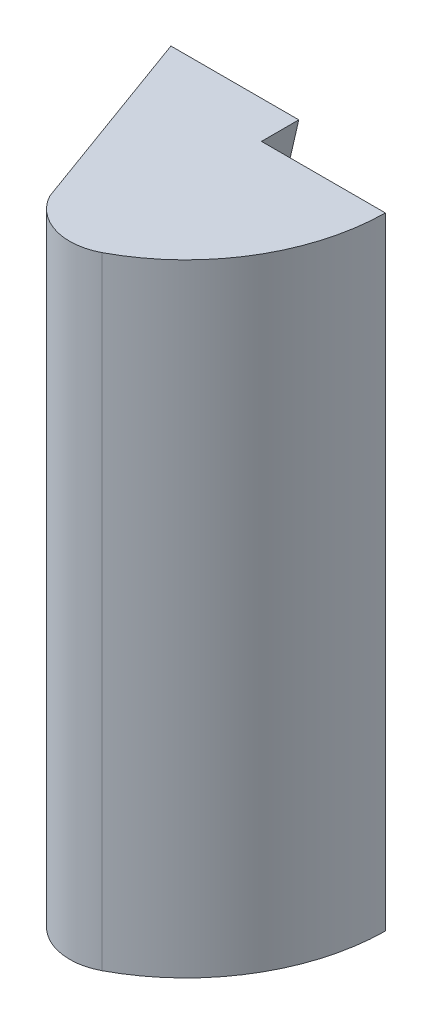
ISO-10303-21;
HEADER;
FILE_DESCRIPTION(('STEP AP214'),'2;1');
FILE_NAME('part.step','',(''),(''),'','','');
FILE_SCHEMA(('AUTOMOTIVE_DESIGN { 1 0 10303 214 1 1 1 1 }'));
ENDSEC;
DATA;
#1=APPLICATION_CONTEXT('core data for automotive mechanical design processes');
#2=APPLICATION_PROTOCOL_DEFINITION('international standard','automotive_design',2000,#1);
#3=PRODUCT_CONTEXT('',#1,'mechanical');
#4=PRODUCT('Part','Part','',(#3));
#5=PRODUCT_RELATED_PRODUCT_CATEGORY('part','',(#4));
#6=PRODUCT_DEFINITION_FORMATION('','',#4);
#7=PRODUCT_DEFINITION_CONTEXT('part definition',#1,'design');
#8=PRODUCT_DEFINITION('design','',#6,#7);
#9=PRODUCT_DEFINITION_SHAPE('','',#8);
#10=(LENGTH_UNIT() NAMED_UNIT(*) SI_UNIT(.MILLI.,.METRE.));
#11=(NAMED_UNIT(*) PLANE_ANGLE_UNIT() SI_UNIT($,.RADIAN.));
#12=(NAMED_UNIT(*) SI_UNIT($,.STERADIAN.) SOLID_ANGLE_UNIT());
#13=UNCERTAINTY_MEASURE_WITH_UNIT(LENGTH_MEASURE(1.E-05),#10,'distance_accuracy_value','');
#14=(GEOMETRIC_REPRESENTATION_CONTEXT(3) GLOBAL_UNCERTAINTY_ASSIGNED_CONTEXT((#13)) GLOBAL_UNIT_ASSIGNED_CONTEXT((#10,
#11,#12)) REPRESENTATION_CONTEXT('',''));
#15=CARTESIAN_POINT('',(0.,0.,0.));
#16=DIRECTION('',(0.,0.,1.));
#17=DIRECTION('',(1.,0.,0.));
#18=AXIS2_PLACEMENT_3D('',#15,#16,#17);
#19=CARTESIAN_POINT('',(-2.81712764111581,0.,-15.9767247746024));
#20=DIRECTION('',(0.,1.,0.));
#21=DIRECTION('',(0.,0.,1.));
#22=AXIS2_PLACEMENT_3D('',#19,#20,#21);
#23=PLANE('',#22);
#24=DIRECTION('',(-1.,0.,0.));
#25=VECTOR('',#24,1.);
#26=CARTESIAN_POINT('',(0.,0.,-15.7938524157181));
#27=LINE('',#26,#25);
#28=CARTESIAN_POINT('',(13.40503313882,0.,-15.7938524157181));
#29=VERTEX_POINT('',#28);
#30=CARTESIAN_POINT('',(3.44087633369856,0.,-15.7938524157181));
#31=VERTEX_POINT('',#30);
#32=EDGE_CURVE('E155',#29,#31,#27,.T.);
#33=ORIENTED_EDGE('',*,*,#32,.F.);
#34=CARTESIAN_POINT('',(-2.81712764111581,0.,-15.9767247746024));
#35=DIRECTION('',(0.,1.,0.));
#36=DIRECTION('',(0.,0.,1.));
#37=AXIS2_PLACEMENT_3D('',#34,#35,#36);
#38=CIRCLE('',#37,16.2231915069055);
#39=CARTESIAN_POINT('',(4.76548522397194,0.,-1.63462155338905));
#40=VERTEX_POINT('',#39);
#41=EDGE_CURVE('E193',#40,#29,#38,.T.);
#42=ORIENTED_EDGE('',*,*,#41,.F.);
#43=CARTESIAN_POINT('',(2.68780975575991,0.,-5.62536315985617));
#44=DIRECTION('',(0.,1.,0.));
#45=DIRECTION('',(0.,0.,1.));
#46=AXIS2_PLACEMENT_3D('',#43,#44,#45);
#47=CIRCLE('',#46,4.49919480805154);
#48=CARTESIAN_POINT('',(-1.26592555584578,0.,-3.47810187939677));
#49=VERTEX_POINT('',#48);
#50=EDGE_CURVE('E187',#49,#40,#47,.T.);
#51=ORIENTED_EDGE('',*,*,#50,.F.);
#52=DIRECTION('',(0.342020143325673,0.,0.939692620785907));
#53=VECTOR('',#52,1.);
#54=CARTESIAN_POINT('',(-6.84040286651345,0.,-18.7938524157181));
#55=LINE('',#54,#53);
#56=CARTESIAN_POINT('',(-6.84040286651345,0.,-18.7938524157181));
#57=VERTEX_POINT('',#56);
#58=EDGE_CURVE('E199',#57,#49,#55,.T.);
#59=ORIENTED_EDGE('',*,*,#58,.F.);
#60=DIRECTION('',(-1.,0.,0.));
#61=VECTOR('',#60,1.);
#62=CARTESIAN_POINT('',(13.1595971334865,0.,-18.7938524157181));
#63=LINE('',#62,#61);
#64=CARTESIAN_POINT('',(3.44087633369856,0.,-18.7938524157181));
#65=VERTEX_POINT('',#64);
#66=EDGE_CURVE('E205',#65,#57,#63,.T.);
#67=ORIENTED_EDGE('',*,*,#66,.F.);
#68=DIRECTION('',(0.,0.,-1.));
#69=VECTOR('',#68,1.);
#70=CARTESIAN_POINT('',(3.44087633369856,0.,-15.7938524157181));
#71=LINE('',#70,#69);
#72=EDGE_CURVE('E173',#31,#65,#71,.T.);
#73=ORIENTED_EDGE('',*,*,#72,.F.);
#74=EDGE_LOOP('',(#33,#42,#51,#59,#67,#73));
#75=FACE_BOUND('',#74,.T.);
#76=ADVANCED_FACE('F36',(#75),#23,.F.);
#77=CARTESIAN_POINT('',(-2.81712764111581,50.,-15.9767247746024));
#78=DIRECTION('',(0.,-1.,0.));
#79=DIRECTION('',(0.,0.,-1.));
#80=AXIS2_PLACEMENT_3D('',#77,#78,#79);
#81=CYLINDRICAL_SURFACE('',#80,16.2231915069055);
#82=DIRECTION('',(0.,-1.,0.));
#83=VECTOR('',#82,1.);
#84=CARTESIAN_POINT('',(13.40503313882,50.,-15.7938524157181));
#85=LINE('',#84,#83);
#86=CARTESIAN_POINT('',(13.40503313882,50.,-15.7938524157181));
#87=VERTEX_POINT('',#86);
#88=EDGE_CURVE('E144',#87,#29,#85,.T.);
#89=ORIENTED_EDGE('',*,*,#88,.F.);
#90=CARTESIAN_POINT('',(-2.81712764111581,50.,-15.9767247746024));
#91=DIRECTION('',(0.,1.,0.));
#92=DIRECTION('',(0.,0.,1.));
#93=AXIS2_PLACEMENT_3D('',#90,#91,#92);
#94=CIRCLE('',#93,16.2231915069055);
#95=CARTESIAN_POINT('',(4.76548522397194,50.,-1.63462155338905));
#96=VERTEX_POINT('',#95);
#97=EDGE_CURVE('E195',#96,#87,#94,.T.);
#98=ORIENTED_EDGE('',*,*,#97,.F.);
#99=DIRECTION('',(0.,1.,0.));
#100=VECTOR('',#99,1.);
#101=CARTESIAN_POINT('',(4.76548522397194,0.,-1.63462155338905));
#102=LINE('',#101,#100);
#103=EDGE_CURVE('E191',#40,#96,#102,.T.);
#104=ORIENTED_EDGE('',*,*,#103,.F.);
#105=ORIENTED_EDGE('',*,*,#41,.T.);
#106=EDGE_LOOP('',(#89,#98,#104,#105));
#107=FACE_BOUND('',#106,.T.);
#108=ADVANCED_FACE('F38',(#107),#81,.T.);
#109=CARTESIAN_POINT('',(-2.81712764111581,50.,-15.9767247746024));
#110=DIRECTION('',(0.,1.,0.));
#111=DIRECTION('',(0.,0.,1.));
#112=AXIS2_PLACEMENT_3D('',#109,#110,#111);
#113=PLANE('',#112);
#114=ORIENTED_EDGE('',*,*,#97,.T.);
#115=DIRECTION('',(1.,0.,0.));
#116=VECTOR('',#115,1.);
#117=CARTESIAN_POINT('',(0.,50.,-15.7938524157181));
#118=LINE('',#117,#116);
#119=CARTESIAN_POINT('',(3.44087633369857,50.,-15.7938524157181));
#120=VERTEX_POINT('',#119);
#121=EDGE_CURVE('E153',#120,#87,#118,.T.);
#122=ORIENTED_EDGE('',*,*,#121,.F.);
#123=DIRECTION('',(0.,0.,-1.));
#124=VECTOR('',#123,1.);
#125=CARTESIAN_POINT('',(3.44087633369857,50.,-15.7938524157181));
#126=LINE('',#125,#124);
#127=CARTESIAN_POINT('',(3.44087633369857,50.,-18.7938524157181));
#128=VERTEX_POINT('',#127);
#129=EDGE_CURVE('E176',#120,#128,#126,.T.);
#130=ORIENTED_EDGE('',*,*,#129,.T.);
#131=DIRECTION('',(-1.,0.,0.));
#132=VECTOR('',#131,1.);
#133=CARTESIAN_POINT('',(13.1595971334865,50.,-18.7938524157181));
#134=LINE('',#133,#132);
#135=CARTESIAN_POINT('',(-6.84040286651345,50.,-18.7938524157181));
#136=VERTEX_POINT('',#135);
#137=EDGE_CURVE('E198',#128,#136,#134,.T.);
#138=ORIENTED_EDGE('',*,*,#137,.T.);
#139=DIRECTION('',(0.342020143325673,0.,0.939692620785907));
#140=VECTOR('',#139,1.);
#141=CARTESIAN_POINT('',(-6.84040286651345,50.,-18.7938524157181));
#142=LINE('',#141,#140);
#143=CARTESIAN_POINT('',(-1.26592555584578,50.,-3.47810187939677));
#144=VERTEX_POINT('',#143);
#145=EDGE_CURVE('E44',#136,#144,#142,.T.);
#146=ORIENTED_EDGE('',*,*,#145,.T.);
#147=CARTESIAN_POINT('',(2.68780975575991,50.,-5.62536315985617));
#148=DIRECTION('',(0.,1.,0.));
#149=DIRECTION('',(0.,0.,1.));
#150=AXIS2_PLACEMENT_3D('',#147,#148,#149);
#151=CIRCLE('',#150,4.49919480805154);
#152=EDGE_CURVE('E184',#144,#96,#151,.T.);
#153=ORIENTED_EDGE('',*,*,#152,.T.);
#154=EDGE_LOOP('',(#114,#122,#130,#138,#146,#153));
#155=FACE_BOUND('',#154,.T.);
#156=ADVANCED_FACE('F223',(#155),#113,.T.);
#157=CARTESIAN_POINT('',(13.1595971334865,50.,-18.7938524157181));
#158=DIRECTION('',(0.,0.,1.));
#159=DIRECTION('',(1.,0.,0.));
#160=AXIS2_PLACEMENT_3D('',#157,#158,#159);
#161=PLANE('',#160);
#162=DIRECTION('',(0.,-1.,0.));
#163=VECTOR('',#162,1.);
#164=CARTESIAN_POINT('',(-1.94561929768702,0.,-18.7938524157181));
#165=LINE('',#164,#163);
#166=CARTESIAN_POINT('',(-1.94561929768702,36.,-18.7938524157181));
#167=VERTEX_POINT('',#166);
#168=CARTESIAN_POINT('',(-1.94561929768702,14.,-18.7938524157181));
#169=VERTEX_POINT('',#168);
#170=EDGE_CURVE('E135',#167,#169,#165,.T.);
#171=ORIENTED_EDGE('',*,*,#170,.T.);
#172=DIRECTION('',(1.,0.,0.));
#173=VECTOR('',#172,1.);
#174=CARTESIAN_POINT('',(0.,14.,-18.7938524157181));
#175=LINE('',#174,#173);
#176=CARTESIAN_POINT('',(0.208721657940766,14.,-18.7938524157181));
#177=VERTEX_POINT('',#176);
#178=EDGE_CURVE('E166',#169,#177,#175,.T.);
#179=ORIENTED_EDGE('',*,*,#178,.T.);
#180=DIRECTION('',(0.224951054343859,-0.974370064785237,0.));
#181=VECTOR('',#180,1.);
#182=CARTESIAN_POINT('',(3.26675774823927,0.754190452181398,-18.7938524157181));
#183=LINE('',#182,#181);
#184=EDGE_CURVE('E51',#177,#65,#183,.T.);
#185=ORIENTED_EDGE('',*,*,#184,.T.);
#186=ORIENTED_EDGE('',*,*,#66,.T.);
#187=DIRECTION('',(0.,-1.,0.));
#188=VECTOR('',#187,1.);
#189=CARTESIAN_POINT('',(-6.84040286651345,50.,-18.7938524157181));
#190=LINE('',#189,#188);
#191=EDGE_CURVE('E12',#136,#57,#190,.T.);
#192=ORIENTED_EDGE('',*,*,#191,.F.);
#193=ORIENTED_EDGE('',*,*,#137,.F.);
#194=DIRECTION('',(-0.224951054343863,-0.974370064785236,0.));
#195=VECTOR('',#194,1.);
#196=CARTESIAN_POINT('',(-7.69252092148749,1.77595839033934,-18.7938524157181));
#197=LINE('',#196,#195);
#198=CARTESIAN_POINT('',(0.208721657940777,36.,-18.7938524157181));
#199=VERTEX_POINT('',#198);
#200=EDGE_CURVE('E150',#128,#199,#197,.T.);
#201=ORIENTED_EDGE('',*,*,#200,.T.);
#202=DIRECTION('',(1.,0.,0.));
#203=VECTOR('',#202,1.);
#204=CARTESIAN_POINT('',(0.,36.,-18.7938524157181));
#205=LINE('',#204,#203);
#206=EDGE_CURVE('E169',#167,#199,#205,.T.);
#207=ORIENTED_EDGE('',*,*,#206,.F.);
#208=EDGE_LOOP('',(#171,#179,#185,#186,#192,#193,#201,#207));
#209=FACE_BOUND('',#208,.T.);
#210=ADVANCED_FACE('F226',(#209),#161,.F.);
#211=CARTESIAN_POINT('',(-6.84040286651345,50.,-18.7938524157181));
#212=DIRECTION('',(0.939692620785907,0.,-0.342020143325673));
#213=DIRECTION('',(-0.342020143325673,0.,-0.939692620785907));
#214=AXIS2_PLACEMENT_3D('',#211,#212,#213);
#215=PLANE('',#214);
#216=DIRECTION('',(0.,1.,0.));
#217=VECTOR('',#216,1.);
#218=CARTESIAN_POINT('',(-1.26592555584578,0.,-3.47810187939677));
#219=LINE('',#218,#217);
#220=EDGE_CURVE('E59',#49,#144,#219,.T.);
#221=ORIENTED_EDGE('',*,*,#220,.T.);
#222=ORIENTED_EDGE('',*,*,#145,.F.);
#223=ORIENTED_EDGE('',*,*,#191,.T.);
#224=ORIENTED_EDGE('',*,*,#58,.T.);
#225=EDGE_LOOP('',(#221,#222,#223,#224));
#226=FACE_BOUND('',#225,.T.);
#227=ADVANCED_FACE('F209',(#226),#215,.F.);
#228=CARTESIAN_POINT('',(2.68780975575991,0.,-5.62536315985617));
#229=DIRECTION('',(0.,1.,0.));
#230=DIRECTION('',(0.,0.,1.));
#231=AXIS2_PLACEMENT_3D('',#228,#229,#230);
#232=CYLINDRICAL_SURFACE('',#231,4.49919480805154);
#233=ORIENTED_EDGE('',*,*,#152,.F.);
#234=ORIENTED_EDGE('',*,*,#220,.F.);
#235=ORIENTED_EDGE('',*,*,#50,.T.);
#236=ORIENTED_EDGE('',*,*,#103,.T.);
#237=EDGE_LOOP('',(#233,#234,#235,#236));
#238=FACE_BOUND('',#237,.T.);
#239=ADVANCED_FACE('F217',(#238),#232,.T.);
#240=CARTESIAN_POINT('',(3.26675774823927,0.754190452181398,-15.7938524157181));
#241=DIRECTION('',(0.974370064785236,0.224951054343859,0.));
#242=DIRECTION('',(-0.224951054343859,0.974370064785237,0.));
#243=AXIS2_PLACEMENT_3D('',#240,#241,#242);
#244=PLANE('',#243);
#245=ORIENTED_EDGE('',*,*,#184,.F.);
#246=DIRECTION('',(0.,0.,-1.));
#247=VECTOR('',#246,1.);
#248=CARTESIAN_POINT('',(0.208721657940766,14.,-15.7938524157181));
#249=LINE('',#248,#247);
#250=CARTESIAN_POINT('',(0.208721657940766,14.,-15.7938524157181));
#251=VERTEX_POINT('',#250);
#252=EDGE_CURVE('E164',#251,#177,#249,.T.);
#253=ORIENTED_EDGE('',*,*,#252,.F.);
#254=DIRECTION('',(0.224951054343859,-0.974370064785237,0.));
#255=VECTOR('',#254,1.);
#256=CARTESIAN_POINT('',(3.26675774823927,0.754190452181398,-15.7938524157181));
#257=LINE('',#256,#255);
#258=EDGE_CURVE('E148',#251,#31,#257,.T.);
#259=ORIENTED_EDGE('',*,*,#258,.T.);
#260=ORIENTED_EDGE('',*,*,#72,.T.);
#261=EDGE_LOOP('',(#245,#253,#259,#260));
#262=FACE_BOUND('',#261,.T.);
#263=ADVANCED_FACE('F229',(#262),#244,.T.);
#264=CARTESIAN_POINT('',(-7.69252092148749,1.77595839033934,-15.7938524157181));
#265=DIRECTION('',(0.974370064785236,-0.224951054343863,0.));
#266=DIRECTION('',(0.224951054343863,0.974370064785236,0.));
#267=AXIS2_PLACEMENT_3D('',#264,#265,#266);
#268=PLANE('',#267);
#269=ORIENTED_EDGE('',*,*,#200,.F.);
#270=ORIENTED_EDGE('',*,*,#129,.F.);
#271=DIRECTION('',(-0.224951054343863,-0.974370064785236,0.));
#272=VECTOR('',#271,1.);
#273=CARTESIAN_POINT('',(-7.69252092148749,1.77595839033934,-15.7938524157181));
#274=LINE('',#273,#272);
#275=CARTESIAN_POINT('',(0.208721657940778,36.,-15.7938524157181));
#276=VERTEX_POINT('',#275);
#277=EDGE_CURVE('E125',#120,#276,#274,.T.);
#278=ORIENTED_EDGE('',*,*,#277,.T.);
#279=DIRECTION('',(0.,0.,-1.));
#280=VECTOR('',#279,1.);
#281=CARTESIAN_POINT('',(0.208721657940778,36.,-15.7938524157181));
#282=LINE('',#281,#280);
#283=EDGE_CURVE('E121',#276,#199,#282,.T.);
#284=ORIENTED_EDGE('',*,*,#283,.T.);
#285=EDGE_LOOP('',(#269,#270,#278,#284));
#286=FACE_BOUND('',#285,.T.);
#287=ADVANCED_FACE('F231',(#286),#268,.T.);
#288=CARTESIAN_POINT('',(0.,36.,-15.7938524157181));
#289=DIRECTION('',(0.,1.,0.));
#290=DIRECTION('',(0.,0.,1.));
#291=AXIS2_PLACEMENT_3D('',#288,#289,#290);
#292=PLANE('',#291);
#293=ORIENTED_EDGE('',*,*,#206,.T.);
#294=ORIENTED_EDGE('',*,*,#283,.F.);
#295=DIRECTION('',(1.,0.,0.));
#296=VECTOR('',#295,1.);
#297=CARTESIAN_POINT('',(0.,36.,-15.7938524157181));
#298=LINE('',#297,#296);
#299=CARTESIAN_POINT('',(-1.94561929768702,36.,-15.7938524157181));
#300=VERTEX_POINT('',#299);
#301=EDGE_CURVE('E115',#300,#276,#298,.T.);
#302=ORIENTED_EDGE('',*,*,#301,.F.);
#303=DIRECTION('',(0.,0.,-1.));
#304=VECTOR('',#303,1.);
#305=CARTESIAN_POINT('',(-1.94561929768702,36.,-15.7938524157181));
#306=LINE('',#305,#304);
#307=EDGE_CURVE('E119',#300,#167,#306,.T.);
#308=ORIENTED_EDGE('',*,*,#307,.T.);
#309=EDGE_LOOP('',(#293,#294,#302,#308));
#310=FACE_BOUND('',#309,.T.);
#311=ADVANCED_FACE('F118',(#310),#292,.F.);
#312=CARTESIAN_POINT('',(0.,14.,-15.7938524157181));
#313=DIRECTION('',(0.,1.,0.));
#314=DIRECTION('',(0.,0.,1.));
#315=AXIS2_PLACEMENT_3D('',#312,#313,#314);
#316=PLANE('',#315);
#317=ORIENTED_EDGE('',*,*,#178,.F.);
#318=DIRECTION('',(0.,0.,-1.));
#319=VECTOR('',#318,1.);
#320=CARTESIAN_POINT('',(-1.94561929768702,14.,-15.7938524157181));
#321=LINE('',#320,#319);
#322=CARTESIAN_POINT('',(-1.94561929768702,14.,-15.7938524157181));
#323=VERTEX_POINT('',#322);
#324=EDGE_CURVE('E136',#323,#169,#321,.T.);
#325=ORIENTED_EDGE('',*,*,#324,.F.);
#326=DIRECTION('',(1.,0.,0.));
#327=VECTOR('',#326,1.);
#328=CARTESIAN_POINT('',(0.,14.,-15.7938524157181));
#329=LINE('',#328,#327);
#330=EDGE_CURVE('E126',#323,#251,#329,.T.);
#331=ORIENTED_EDGE('',*,*,#330,.T.);
#332=ORIENTED_EDGE('',*,*,#252,.T.);
#333=EDGE_LOOP('',(#317,#325,#331,#332));
#334=FACE_BOUND('',#333,.T.);
#335=ADVANCED_FACE('F228',(#334),#316,.T.);
#336=CARTESIAN_POINT('',(0.,0.,-15.7938524157181));
#337=DIRECTION('',(0.,0.,-1.));
#338=DIRECTION('',(-1.,0.,0.));
#339=AXIS2_PLACEMENT_3D('',#336,#337,#338);
#340=PLANE('',#339);
#341=ORIENTED_EDGE('',*,*,#258,.F.);
#342=ORIENTED_EDGE('',*,*,#330,.F.);
#343=DIRECTION('',(0.,-1.,0.));
#344=VECTOR('',#343,1.);
#345=CARTESIAN_POINT('',(-1.94561929768702,0.,-15.7938524157181));
#346=LINE('',#345,#344);
#347=EDGE_CURVE('E132',#300,#323,#346,.T.);
#348=ORIENTED_EDGE('',*,*,#347,.F.);
#349=ORIENTED_EDGE('',*,*,#301,.T.);
#350=ORIENTED_EDGE('',*,*,#277,.F.);
#351=ORIENTED_EDGE('',*,*,#121,.T.);
#352=ORIENTED_EDGE('',*,*,#88,.T.);
#353=ORIENTED_EDGE('',*,*,#32,.T.);
#354=EDGE_LOOP('',(#341,#342,#348,#349,#350,#351,#352,#353));
#355=FACE_BOUND('',#354,.T.);
#356=CARTESIAN_POINT('',(3.15959713348655,31.,-15.7938524157181));
#357=DIRECTION('',(0.,0.,-1.));
#358=DIRECTION('',(-1.,0.,0.));
#359=AXIS2_PLACEMENT_3D('',#356,#357,#358);
#360=CIRCLE('',#359,1.6);
#361=CARTESIAN_POINT('',(1.55959713348655,31.,-15.7938524157181));
#362=VERTEX_POINT('',#361);
#363=EDGE_CURVE('E158',#362,#362,#360,.F.);
#364=ORIENTED_EDGE('',*,*,#363,.T.);
#365=EDGE_LOOP('',(#364));
#366=FACE_BOUND('',#365,.T.);
#367=CARTESIAN_POINT('',(3.15959713348655,19.,-15.7938524157181));
#368=DIRECTION('',(0.,0.,-1.));
#369=DIRECTION('',(-1.,0.,0.));
#370=AXIS2_PLACEMENT_3D('',#367,#368,#369);
#371=CIRCLE('',#370,1.6);
#372=CARTESIAN_POINT('',(1.55959713348655,19.,-15.7938524157181));
#373=VERTEX_POINT('',#372);
#374=EDGE_CURVE('E161',#373,#373,#371,.F.);
#375=ORIENTED_EDGE('',*,*,#374,.T.);
#376=EDGE_LOOP('',(#375));
#377=FACE_BOUND('',#376,.T.);
#378=ADVANCED_FACE('F139',(#355,#366,#377),#340,.T.);
#379=CARTESIAN_POINT('',(3.15959713348655,31.,-3.79385241571814));
#380=DIRECTION('',(0.,0.,-1.));
#381=DIRECTION('',(-1.,0.,0.));
#382=AXIS2_PLACEMENT_3D('',#379,#380,#381);
#383=PLANE('',#382);
#384=CARTESIAN_POINT('',(3.15959713348655,31.,-3.79385241571814));
#385=DIRECTION('',(0.,0.,-1.));
#386=DIRECTION('',(-1.,0.,0.));
#387=AXIS2_PLACEMENT_3D('',#384,#385,#386);
#388=CIRCLE('',#387,1.6);
#389=CARTESIAN_POINT('',(1.55959713348655,31.,-3.79385241571814));
#390=VERTEX_POINT('',#389);
#391=EDGE_CURVE('E175',#390,#390,#388,.T.);
#392=ORIENTED_EDGE('',*,*,#391,.T.);
#393=EDGE_LOOP('',(#392));
#394=FACE_BOUND('',#393,.T.);
#395=ADVANCED_FACE('F288',(#394),#383,.T.);
#396=CARTESIAN_POINT('',(3.15959713348655,31.,-3.79385241571814));
#397=DIRECTION('',(0.,0.,-1.));
#398=DIRECTION('',(-1.,0.,0.));
#399=AXIS2_PLACEMENT_3D('',#396,#397,#398);
#400=CYLINDRICAL_SURFACE('',#399,1.6);
#401=ORIENTED_EDGE('',*,*,#391,.F.);
#402=EDGE_LOOP('',(#401));
#403=FACE_BOUND('',#402,.T.);
#404=ORIENTED_EDGE('',*,*,#363,.F.);
#405=EDGE_LOOP('',(#404));
#406=FACE_BOUND('',#405,.T.);
#407=ADVANCED_FACE('F285',(#403,#406),#400,.F.);
#408=CARTESIAN_POINT('',(3.15959713348655,19.,-3.79385241571814));
#409=DIRECTION('',(0.,0.,-1.));
#410=DIRECTION('',(-1.,0.,0.));
#411=AXIS2_PLACEMENT_3D('',#408,#409,#410);
#412=PLANE('',#411);
#413=CARTESIAN_POINT('',(3.15959713348655,19.,-3.79385241571814));
#414=DIRECTION('',(0.,0.,-1.));
#415=DIRECTION('',(-1.,0.,0.));
#416=AXIS2_PLACEMENT_3D('',#413,#414,#415);
#417=CIRCLE('',#416,1.6);
#418=CARTESIAN_POINT('',(1.55959713348655,19.,-3.79385241571814));
#419=VERTEX_POINT('',#418);
#420=EDGE_CURVE('E181',#419,#419,#417,.T.);
#421=ORIENTED_EDGE('',*,*,#420,.T.);
#422=EDGE_LOOP('',(#421));
#423=FACE_BOUND('',#422,.T.);
#424=ADVANCED_FACE('F275',(#423),#412,.T.);
#425=CARTESIAN_POINT('',(3.15959713348655,19.,-3.79385241571814));
#426=DIRECTION('',(0.,0.,-1.));
#427=DIRECTION('',(-1.,0.,0.));
#428=AXIS2_PLACEMENT_3D('',#425,#426,#427);
#429=CYLINDRICAL_SURFACE('',#428,1.6);
#430=ORIENTED_EDGE('',*,*,#420,.F.);
#431=EDGE_LOOP('',(#430));
#432=FACE_BOUND('',#431,.T.);
#433=ORIENTED_EDGE('',*,*,#374,.F.);
#434=EDGE_LOOP('',(#433));
#435=FACE_BOUND('',#434,.T.);
#436=ADVANCED_FACE('F270',(#432,#435),#429,.F.);
#437=CARTESIAN_POINT('',(-1.94561929768702,0.,-15.7938524157181));
#438=DIRECTION('',(1.,0.,0.));
#439=DIRECTION('',(0.,0.,-1.));
#440=AXIS2_PLACEMENT_3D('',#437,#438,#439);
#441=PLANE('',#440);
#442=ORIENTED_EDGE('',*,*,#170,.F.);
#443=ORIENTED_EDGE('',*,*,#307,.F.);
#444=ORIENTED_EDGE('',*,*,#347,.T.);
#445=ORIENTED_EDGE('',*,*,#324,.T.);
#446=EDGE_LOOP('',(#442,#443,#444,#445));
#447=FACE_BOUND('',#446,.T.);
#448=ADVANCED_FACE('F130',(#447),#441,.T.);
#449=CLOSED_SHELL('',(#76,#108,#156,#210,#227,#239,#263,#287,#311,#335,#378,#395,#407,#424,#436,#448));
#450=MANIFOLD_SOLID_BREP('B2',#449);
#451=ADVANCED_BREP_SHAPE_REPRESENTATION('',(#18,#450),#14);
#452=SHAPE_DEFINITION_REPRESENTATION(#9,#451);
ENDSEC;
END-ISO-10303-21;
